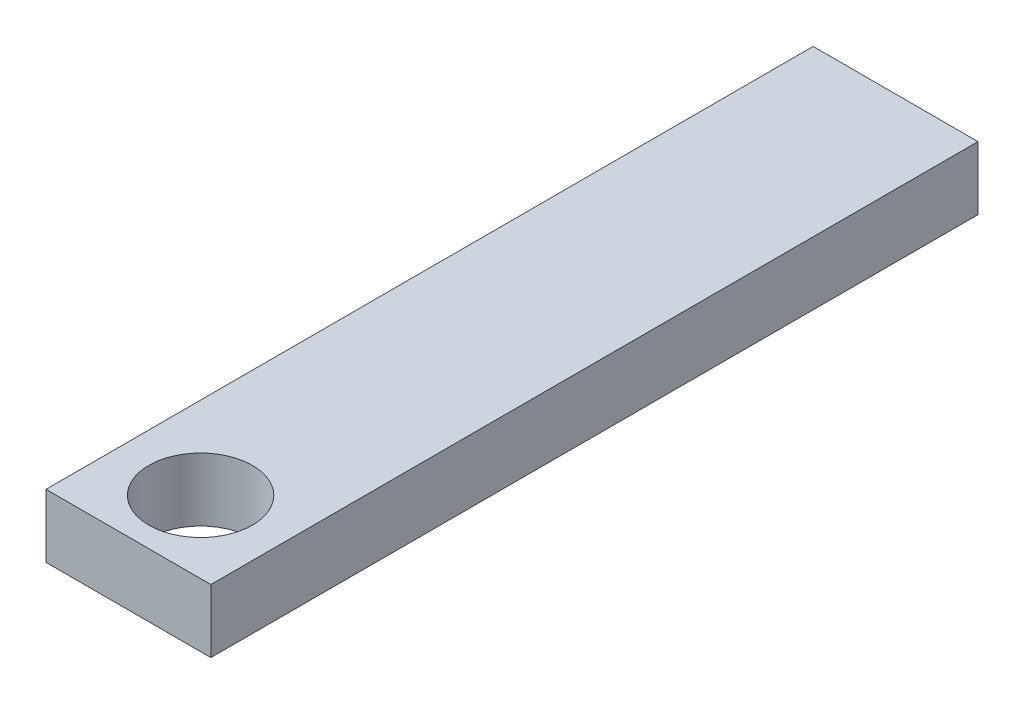
ISO-10303-21;
HEADER;
FILE_DESCRIPTION(('STEP AP214'),'2;1');
FILE_NAME('part.step','',(''),(''),'','','');
FILE_SCHEMA(('AUTOMOTIVE_DESIGN { 1 0 10303 214 1 1 1 1 }'));
ENDSEC;
DATA;
#1=APPLICATION_CONTEXT('core data for automotive mechanical design processes');
#2=APPLICATION_PROTOCOL_DEFINITION('international standard','automotive_design',2000,#1);
#3=PRODUCT_CONTEXT('',#1,'mechanical');
#4=PRODUCT('Part','Part','',(#3));
#5=PRODUCT_RELATED_PRODUCT_CATEGORY('part','',(#4));
#6=PRODUCT_DEFINITION_FORMATION('','',#4);
#7=PRODUCT_DEFINITION_CONTEXT('part definition',#1,'design');
#8=PRODUCT_DEFINITION('design','',#6,#7);
#9=PRODUCT_DEFINITION_SHAPE('','',#8);
#10=(LENGTH_UNIT() NAMED_UNIT(*) SI_UNIT(.MILLI.,.METRE.));
#11=(NAMED_UNIT(*) PLANE_ANGLE_UNIT() SI_UNIT($,.RADIAN.));
#12=(NAMED_UNIT(*) SI_UNIT($,.STERADIAN.) SOLID_ANGLE_UNIT());
#13=UNCERTAINTY_MEASURE_WITH_UNIT(LENGTH_MEASURE(1.E-05),#10,'distance_accuracy_value','');
#14=(GEOMETRIC_REPRESENTATION_CONTEXT(3) GLOBAL_UNCERTAINTY_ASSIGNED_CONTEXT((#13)) GLOBAL_UNIT_ASSIGNED_CONTEXT((#10,
#11,#12)) REPRESENTATION_CONTEXT('',''));
#15=CARTESIAN_POINT('',(0.,0.,0.));
#16=DIRECTION('',(0.,0.,1.));
#17=DIRECTION('',(1.,0.,0.));
#18=AXIS2_PLACEMENT_3D('',#15,#16,#17);
#19=CARTESIAN_POINT('',(0.,2.54,0.));
#20=DIRECTION('',(0.,-1.,0.));
#21=DIRECTION('',(0.,0.,-1.));
#22=AXIS2_PLACEMENT_3D('',#19,#20,#21);
#23=PLANE('',#22);
#24=DIRECTION('',(0.,0.,1.));
#25=VECTOR('',#24,1.);
#26=CARTESIAN_POINT('',(0.,2.54,25.4507037037037));
#27=LINE('',#26,#25);
#28=CARTESIAN_POINT('',(0.,2.54,0.));
#29=VERTEX_POINT('',#28);
#30=CARTESIAN_POINT('',(0.,2.54,30.7969973659411));
#31=VERTEX_POINT('',#30);
#32=EDGE_CURVE('E78',#29,#31,#27,.T.);
#33=ORIENTED_EDGE('',*,*,#32,.T.);
#34=DIRECTION('',(1.,0.,0.));
#35=VECTOR('',#34,1.);
#36=CARTESIAN_POINT('',(0.,2.54,30.7969973659411));
#37=LINE('',#36,#35);
#38=CARTESIAN_POINT('',(6.618,2.54,30.7969973659411));
#39=VERTEX_POINT('',#38);
#40=EDGE_CURVE('E81',#31,#39,#37,.T.);
#41=ORIENTED_EDGE('',*,*,#40,.T.);
#42=DIRECTION('',(0.,0.,-1.));
#43=VECTOR('',#42,1.);
#44=CARTESIAN_POINT('',(6.618,2.54,30.7969973659411));
#45=LINE('',#44,#43);
#46=CARTESIAN_POINT('',(6.618,2.54,0.));
#47=VERTEX_POINT('',#46);
#48=EDGE_CURVE('E85',#39,#47,#45,.T.);
#49=ORIENTED_EDGE('',*,*,#48,.T.);
#50=DIRECTION('',(-1.,0.,0.));
#51=VECTOR('',#50,1.);
#52=CARTESIAN_POINT('',(0.,2.54,0.));
#53=LINE('',#52,#51);
#54=EDGE_CURVE('E50',#47,#29,#53,.T.);
#55=ORIENTED_EDGE('',*,*,#54,.T.);
#56=EDGE_LOOP('',(#33,#41,#49,#55));
#57=FACE_BOUND('',#56,.T.);
#58=CARTESIAN_POINT('',(3.309,2.54,27.9));
#59=DIRECTION('',(0.,1.,0.));
#60=DIRECTION('',(0.,0.,1.));
#61=AXIS2_PLACEMENT_3D('',#58,#59,#60);
#62=CIRCLE('',#61,2.07899);
#63=CARTESIAN_POINT('',(3.309,2.54,29.97899));
#64=VERTEX_POINT('',#63);
#65=EDGE_CURVE('E99',#64,#64,#62,.T.);
#66=ORIENTED_EDGE('',*,*,#65,.F.);
#67=EDGE_LOOP('',(#66));
#68=FACE_BOUND('',#67,.T.);
#69=ADVANCED_FACE('F33',(#57,#68),#23,.F.);
#70=CARTESIAN_POINT('',(0.,0.,0.));
#71=DIRECTION('',(0.,-1.,0.));
#72=DIRECTION('',(0.,0.,-1.));
#73=AXIS2_PLACEMENT_3D('',#70,#71,#72);
#74=PLANE('',#73);
#75=DIRECTION('',(0.,0.,1.));
#76=VECTOR('',#75,1.);
#77=CARTESIAN_POINT('',(0.,0.,27.9));
#78=LINE('',#77,#76);
#79=CARTESIAN_POINT('',(0.,0.,0.));
#80=VERTEX_POINT('',#79);
#81=CARTESIAN_POINT('',(0.,0.,30.7969973659411));
#82=VERTEX_POINT('',#81);
#83=EDGE_CURVE('E73',#80,#82,#78,.T.);
#84=ORIENTED_EDGE('',*,*,#83,.F.);
#85=DIRECTION('',(-1.,0.,0.));
#86=VECTOR('',#85,1.);
#87=CARTESIAN_POINT('',(0.,0.,0.));
#88=LINE('',#87,#86);
#89=CARTESIAN_POINT('',(6.618,0.,0.));
#90=VERTEX_POINT('',#89);
#91=EDGE_CURVE('E102',#90,#80,#88,.T.);
#92=ORIENTED_EDGE('',*,*,#91,.F.);
#93=DIRECTION('',(0.,0.,-1.));
#94=VECTOR('',#93,1.);
#95=CARTESIAN_POINT('',(6.618,0.,0.));
#96=LINE('',#95,#94);
#97=CARTESIAN_POINT('',(6.618,0.,30.7969973659411));
#98=VERTEX_POINT('',#97);
#99=EDGE_CURVE('E66',#98,#90,#96,.T.);
#100=ORIENTED_EDGE('',*,*,#99,.F.);
#101=DIRECTION('',(1.,0.,0.));
#102=VECTOR('',#101,1.);
#103=CARTESIAN_POINT('',(0.,0.,30.7969973659411));
#104=LINE('',#103,#102);
#105=EDGE_CURVE('E90',#82,#98,#104,.T.);
#106=ORIENTED_EDGE('',*,*,#105,.F.);
#107=EDGE_LOOP('',(#84,#92,#100,#106));
#108=FACE_BOUND('',#107,.T.);
#109=CARTESIAN_POINT('',(3.309,0.,27.9));
#110=DIRECTION('',(0.,1.,0.));
#111=DIRECTION('',(0.,0.,1.));
#112=AXIS2_PLACEMENT_3D('',#109,#110,#111);
#113=CIRCLE('',#112,2.07899);
#114=CARTESIAN_POINT('',(3.309,0.,29.97899));
#115=VERTEX_POINT('',#114);
#116=EDGE_CURVE('E114',#115,#115,#113,.T.);
#117=ORIENTED_EDGE('',*,*,#116,.T.);
#118=EDGE_LOOP('',(#117));
#119=FACE_BOUND('',#118,.T.);
#120=ADVANCED_FACE('F108',(#108,#119),#74,.T.);
#121=CARTESIAN_POINT('',(0.,2.54,27.9));
#122=DIRECTION('',(1.,0.,0.));
#123=DIRECTION('',(0.,0.,-1.));
#124=AXIS2_PLACEMENT_3D('',#121,#122,#123);
#125=PLANE('',#124);
#126=ORIENTED_EDGE('',*,*,#83,.T.);
#127=DIRECTION('',(0.,-1.,0.));
#128=VECTOR('',#127,1.);
#129=CARTESIAN_POINT('',(0.,2.54,30.7969973659411));
#130=LINE('',#129,#128);
#131=EDGE_CURVE('E11',#31,#82,#130,.T.);
#132=ORIENTED_EDGE('',*,*,#131,.F.);
#133=ORIENTED_EDGE('',*,*,#32,.F.);
#134=DIRECTION('',(0.,-1.,0.));
#135=VECTOR('',#134,1.);
#136=CARTESIAN_POINT('',(0.,2.54,0.));
#137=LINE('',#136,#135);
#138=EDGE_CURVE('E94',#29,#80,#137,.T.);
#139=ORIENTED_EDGE('',*,*,#138,.T.);
#140=EDGE_LOOP('',(#126,#132,#133,#139));
#141=FACE_BOUND('',#140,.T.);
#142=ADVANCED_FACE('F35',(#141),#125,.F.);
#143=CARTESIAN_POINT('',(0.,2.54,30.7969973659411));
#144=DIRECTION('',(0.,0.,-1.));
#145=DIRECTION('',(-1.,0.,0.));
#146=AXIS2_PLACEMENT_3D('',#143,#144,#145);
#147=PLANE('',#146);
#148=ORIENTED_EDGE('',*,*,#105,.T.);
#149=DIRECTION('',(0.,-1.,0.));
#150=VECTOR('',#149,1.);
#151=CARTESIAN_POINT('',(6.618,2.54,30.7969973659411));
#152=LINE('',#151,#150);
#153=EDGE_CURVE('E42',#39,#98,#152,.T.);
#154=ORIENTED_EDGE('',*,*,#153,.F.);
#155=ORIENTED_EDGE('',*,*,#40,.F.);
#156=ORIENTED_EDGE('',*,*,#131,.T.);
#157=EDGE_LOOP('',(#148,#154,#155,#156));
#158=FACE_BOUND('',#157,.T.);
#159=ADVANCED_FACE('F89',(#158),#147,.F.);
#160=CARTESIAN_POINT('',(6.618,2.54,0.));
#161=DIRECTION('',(-1.,0.,0.));
#162=DIRECTION('',(0.,0.,1.));
#163=AXIS2_PLACEMENT_3D('',#160,#161,#162);
#164=PLANE('',#163);
#165=ORIENTED_EDGE('',*,*,#99,.T.);
#166=DIRECTION('',(0.,-1.,0.));
#167=VECTOR('',#166,1.);
#168=CARTESIAN_POINT('',(6.618,2.54,0.));
#169=LINE('',#168,#167);
#170=EDGE_CURVE('E91',#47,#90,#169,.T.);
#171=ORIENTED_EDGE('',*,*,#170,.F.);
#172=ORIENTED_EDGE('',*,*,#48,.F.);
#173=ORIENTED_EDGE('',*,*,#153,.T.);
#174=EDGE_LOOP('',(#165,#171,#172,#173));
#175=FACE_BOUND('',#174,.T.);
#176=ADVANCED_FACE('F92',(#175),#164,.F.);
#177=CARTESIAN_POINT('',(0.,2.54,0.));
#178=DIRECTION('',(0.,0.,1.));
#179=DIRECTION('',(1.,0.,0.));
#180=AXIS2_PLACEMENT_3D('',#177,#178,#179);
#181=PLANE('',#180);
#182=ORIENTED_EDGE('',*,*,#91,.T.);
#183=ORIENTED_EDGE('',*,*,#138,.F.);
#184=ORIENTED_EDGE('',*,*,#54,.F.);
#185=ORIENTED_EDGE('',*,*,#170,.T.);
#186=EDGE_LOOP('',(#182,#183,#184,#185));
#187=FACE_BOUND('',#186,.T.);
#188=ADVANCED_FACE('F107',(#187),#181,.F.);
#189=CARTESIAN_POINT('',(3.309,2.54,27.9));
#190=DIRECTION('',(0.,-1.,0.));
#191=DIRECTION('',(0.,0.,-1.));
#192=AXIS2_PLACEMENT_3D('',#189,#190,#191);
#193=CYLINDRICAL_SURFACE('',#192,2.07899);
#194=ORIENTED_EDGE('',*,*,#65,.T.);
#195=EDGE_LOOP('',(#194));
#196=FACE_BOUND('',#195,.T.);
#197=ORIENTED_EDGE('',*,*,#116,.F.);
#198=EDGE_LOOP('',(#197));
#199=FACE_BOUND('',#198,.T.);
#200=ADVANCED_FACE('F121',(#196,#199),#193,.F.);
#201=CLOSED_SHELL('',(#69,#120,#142,#159,#176,#188,#200));
#202=MANIFOLD_SOLID_BREP('B2',#201);
#203=ADVANCED_BREP_SHAPE_REPRESENTATION('',(#18,#202),#14);
#204=SHAPE_DEFINITION_REPRESENTATION(#9,#203);
ENDSEC;
END-ISO-10303-21;
